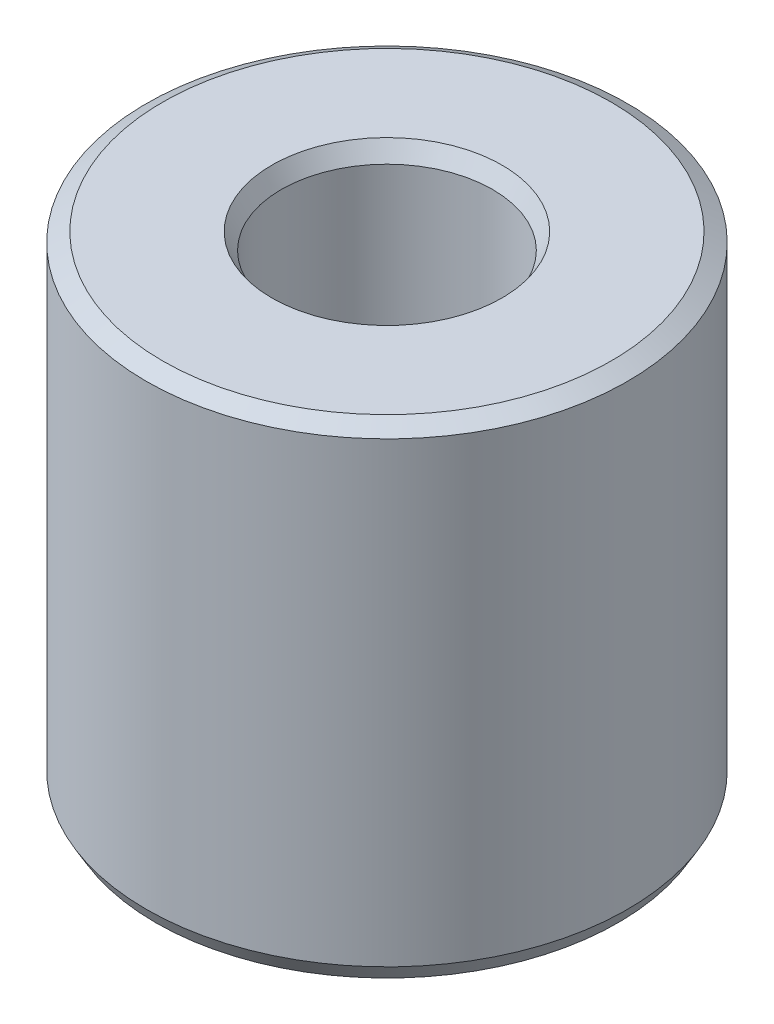
ISO-10303-21;
HEADER;
FILE_DESCRIPTION(('STEP AP214'),'2;1');
FILE_NAME('part.step','',(''),(''),'','','');
FILE_SCHEMA(('AUTOMOTIVE_DESIGN { 1 0 10303 214 1 1 1 1 }'));
ENDSEC;
DATA;
#1=APPLICATION_CONTEXT('core data for automotive mechanical design processes');
#2=APPLICATION_PROTOCOL_DEFINITION('international standard','automotive_design',2000,#1);
#3=PRODUCT_CONTEXT('',#1,'mechanical');
#4=PRODUCT('Part','Part','',(#3));
#5=PRODUCT_RELATED_PRODUCT_CATEGORY('part','',(#4));
#6=PRODUCT_DEFINITION_FORMATION('','',#4);
#7=PRODUCT_DEFINITION_CONTEXT('part definition',#1,'design');
#8=PRODUCT_DEFINITION('design','',#6,#7);
#9=PRODUCT_DEFINITION_SHAPE('','',#8);
#10=(LENGTH_UNIT() NAMED_UNIT(*) SI_UNIT(.MILLI.,.METRE.));
#11=(NAMED_UNIT(*) PLANE_ANGLE_UNIT() SI_UNIT($,.RADIAN.));
#12=(NAMED_UNIT(*) SI_UNIT($,.STERADIAN.) SOLID_ANGLE_UNIT());
#13=UNCERTAINTY_MEASURE_WITH_UNIT(LENGTH_MEASURE(1.E-05),#10,'distance_accuracy_value','');
#14=(GEOMETRIC_REPRESENTATION_CONTEXT(3) GLOBAL_UNCERTAINTY_ASSIGNED_CONTEXT((#13)) GLOBAL_UNIT_ASSIGNED_CONTEXT((#10,
#11,#12)) REPRESENTATION_CONTEXT('',''));
#15=CARTESIAN_POINT('',(0.,0.,0.));
#16=DIRECTION('',(0.,0.,1.));
#17=DIRECTION('',(1.,0.,0.));
#18=AXIS2_PLACEMENT_3D('',#15,#16,#17);
#19=CARTESIAN_POINT('',(0.,15.0570823456874,0.));
#20=DIRECTION('',(0.,-1.,0.));
#21=DIRECTION('',(0.,0.,-1.));
#22=AXIS2_PLACEMENT_3D('',#19,#20,#21);
#23=CYLINDRICAL_SURFACE('',#22,7.5);
#24=CARTESIAN_POINT('',(0.,0.51015463195985,0.));
#25=DIRECTION('',(0.,1.,0.));
#26=DIRECTION('',(0.,0.,1.));
#27=AXIS2_PLACEMENT_3D('',#24,#25,#26);
#28=CIRCLE('',#27,7.5);
#29=CARTESIAN_POINT('',(0.,0.51015463195985,7.5));
#30=VERTEX_POINT('',#29);
#31=EDGE_CURVE('E10',#30,#30,#28,.T.);
#32=ORIENTED_EDGE('',*,*,#31,.T.);
#33=EDGE_LOOP('',(#32));
#34=FACE_BOUND('',#33,.T.);
#35=CARTESIAN_POINT('',(0.,14.7625444315971,0.));
#36=DIRECTION('',(0.,1.,0.));
#37=DIRECTION('',(0.,0.,1.));
#38=AXIS2_PLACEMENT_3D('',#35,#36,#37);
#39=CIRCLE('',#38,7.5);
#40=CARTESIAN_POINT('',(0.,14.7625444315971,7.5));
#41=VERTEX_POINT('',#40);
#42=EDGE_CURVE('E50',#41,#41,#39,.F.);
#43=ORIENTED_EDGE('',*,*,#42,.T.);
#44=EDGE_LOOP('',(#43));
#45=FACE_BOUND('',#44,.T.);
#46=ADVANCED_FACE('F39',(#34,#45),#23,.T.);
#47=CARTESIAN_POINT('',(0.,15.0570823456874,0.));
#48=DIRECTION('',(0.,1.,0.));
#49=DIRECTION('',(0.,0.,1.));
#50=AXIS2_PLACEMENT_3D('',#47,#48,#49);
#51=PLANE('',#50);
#52=CARTESIAN_POINT('',(0.,15.0570823456874,0.));
#53=DIRECTION('',(0.,1.,0.));
#54=DIRECTION('',(0.,0.,1.));
#55=AXIS2_PLACEMENT_3D('',#52,#53,#54);
#56=CIRCLE('',#55,3.58817259000457);
#57=CARTESIAN_POINT('',(0.,15.0570823456874,3.58817259000457));
#58=VERTEX_POINT('',#57);
#59=EDGE_CURVE('E58',#58,#58,#56,.F.);
#60=ORIENTED_EDGE('',*,*,#59,.T.);
#61=EDGE_LOOP('',(#60));
#62=FACE_BOUND('',#61,.T.);
#63=CARTESIAN_POINT('',(0.,15.0570823456874,0.));
#64=DIRECTION('',(0.,1.,0.));
#65=DIRECTION('',(0.,0.,1.));
#66=AXIS2_PLACEMENT_3D('',#63,#64,#65);
#67=CIRCLE('',#66,6.98984536804015);
#68=CARTESIAN_POINT('',(0.,15.0570823456874,6.98984536804015));
#69=VERTEX_POINT('',#68);
#70=EDGE_CURVE('E61',#69,#69,#67,.T.);
#71=ORIENTED_EDGE('',*,*,#70,.T.);
#72=EDGE_LOOP('',(#71));
#73=FACE_BOUND('',#72,.T.);
#74=ADVANCED_FACE('F88',(#62,#73),#51,.T.);
#75=CARTESIAN_POINT('',(0.,0.,0.));
#76=DIRECTION('',(0.,1.,0.));
#77=DIRECTION('',(0.,0.,1.));
#78=AXIS2_PLACEMENT_3D('',#75,#76,#77);
#79=PLANE('',#78);
#80=CARTESIAN_POINT('',(0.,0.,0.));
#81=DIRECTION('',(0.,1.,0.));
#82=DIRECTION('',(0.,0.,1.));
#83=AXIS2_PLACEMENT_3D('',#80,#81,#82);
#84=CIRCLE('',#83,3.80378930787406);
#85=CARTESIAN_POINT('',(0.,0.,3.80378930787406));
#86=VERTEX_POINT('',#85);
#87=EDGE_CURVE('E51',#86,#86,#84,.T.);
#88=ORIENTED_EDGE('',*,*,#87,.T.);
#89=EDGE_LOOP('',(#88));
#90=FACE_BOUND('',#89,.T.);
#91=CARTESIAN_POINT('',(0.,0.,0.));
#92=DIRECTION('',(0.,1.,0.));
#93=DIRECTION('',(0.,0.,1.));
#94=AXIS2_PLACEMENT_3D('',#91,#92,#93);
#95=CIRCLE('',#94,7.20546208590964);
#96=CARTESIAN_POINT('',(0.,0.,7.20546208590964));
#97=VERTEX_POINT('',#96);
#98=EDGE_CURVE('E54',#97,#97,#95,.F.);
#99=ORIENTED_EDGE('',*,*,#98,.T.);
#100=EDGE_LOOP('',(#99));
#101=FACE_BOUND('',#100,.T.);
#102=ADVANCED_FACE('F83',(#90,#101),#79,.F.);
#103=CARTESIAN_POINT('',(0.,15.0570823456874,0.));
#104=DIRECTION('',(0.,-1.,0.));
#105=DIRECTION('',(0.,0.,-1.));
#106=AXIS2_PLACEMENT_3D('',#103,#104,#105);
#107=CYLINDRICAL_SURFACE('',#106,3.29363467591421);
#108=CARTESIAN_POINT('',(0.,14.5469277137276,0.));
#109=DIRECTION('',(0.,1.,0.));
#110=DIRECTION('',(0.,0.,1.));
#111=AXIS2_PLACEMENT_3D('',#108,#109,#110);
#112=CIRCLE('',#111,3.29363467591421);
#113=CARTESIAN_POINT('',(0.,14.5469277137276,3.29363467591421));
#114=VERTEX_POINT('',#113);
#115=EDGE_CURVE('E67',#114,#114,#112,.T.);
#116=ORIENTED_EDGE('',*,*,#115,.T.);
#117=EDGE_LOOP('',(#116));
#118=FACE_BOUND('',#117,.T.);
#119=CARTESIAN_POINT('',(0.,0.294537914090356,0.));
#120=DIRECTION('',(0.,1.,0.));
#121=DIRECTION('',(0.,0.,1.));
#122=AXIS2_PLACEMENT_3D('',#119,#120,#121);
#123=CIRCLE('',#122,3.29363467591421);
#124=CARTESIAN_POINT('',(0.,0.294537914090356,3.29363467591421));
#125=VERTEX_POINT('',#124);
#126=EDGE_CURVE('E69',#125,#125,#123,.F.);
#127=ORIENTED_EDGE('',*,*,#126,.T.);
#128=EDGE_LOOP('',(#127));
#129=FACE_BOUND('',#128,.T.);
#130=ADVANCED_FACE('F71',(#118,#129),#107,.F.);
#131=CARTESIAN_POINT('',(0.,14.5469277137276,0.));
#132=DIRECTION('',(0.,1.,0.));
#133=DIRECTION('',(0.,0.,1.));
#134=AXIS2_PLACEMENT_3D('',#131,#132,#133);
#135=CONICAL_SURFACE('',#134,3.29363467591421,0.523598775598304);
#136=ORIENTED_EDGE('',*,*,#59,.F.);
#137=EDGE_LOOP('',(#136));
#138=FACE_BOUND('',#137,.T.);
#139=ORIENTED_EDGE('',*,*,#115,.F.);
#140=EDGE_LOOP('',(#139));
#141=FACE_BOUND('',#140,.T.);
#142=ADVANCED_FACE('F77',(#138,#141),#135,.F.);
#143=CARTESIAN_POINT('',(0.,0.,0.));
#144=DIRECTION('',(0.,-1.,0.));
#145=DIRECTION('',(0.,0.,-1.));
#146=AXIS2_PLACEMENT_3D('',#143,#144,#145);
#147=CONICAL_SURFACE('',#146,3.80378930787406,1.0471975511966);
#148=ORIENTED_EDGE('',*,*,#126,.F.);
#149=EDGE_LOOP('',(#148));
#150=FACE_BOUND('',#149,.T.);
#151=ORIENTED_EDGE('',*,*,#87,.F.);
#152=EDGE_LOOP('',(#151));
#153=FACE_BOUND('',#152,.T.);
#154=ADVANCED_FACE('F73',(#150,#153),#147,.F.);
#155=CARTESIAN_POINT('',(0.,0.51015463195985,0.));
#156=DIRECTION('',(0.,1.,0.));
#157=DIRECTION('',(0.,0.,1.));
#158=AXIS2_PLACEMENT_3D('',#155,#156,#157);
#159=CONICAL_SURFACE('',#158,7.5,0.523598775598302);
#160=ORIENTED_EDGE('',*,*,#98,.F.);
#161=EDGE_LOOP('',(#160));
#162=FACE_BOUND('',#161,.T.);
#163=ORIENTED_EDGE('',*,*,#31,.F.);
#164=EDGE_LOOP('',(#163));
#165=FACE_BOUND('',#164,.T.);
#166=ADVANCED_FACE('F76',(#162,#165),#159,.T.);
#167=CARTESIAN_POINT('',(0.,15.0570823456874,0.));
#168=DIRECTION('',(0.,-1.,0.));
#169=DIRECTION('',(0.,0.,-1.));
#170=AXIS2_PLACEMENT_3D('',#167,#168,#169);
#171=CONICAL_SURFACE('',#170,6.98984536804015,1.0471975511966);
#172=ORIENTED_EDGE('',*,*,#42,.F.);
#173=EDGE_LOOP('',(#172));
#174=FACE_BOUND('',#173,.T.);
#175=ORIENTED_EDGE('',*,*,#70,.F.);
#176=EDGE_LOOP('',(#175));
#177=FACE_BOUND('',#176,.T.);
#178=ADVANCED_FACE('F45',(#174,#177),#171,.T.);
#179=CLOSED_SHELL('',(#46,#74,#102,#130,#142,#154,#166,#178));
#180=MANIFOLD_SOLID_BREP('B2',#179);
#181=ADVANCED_BREP_SHAPE_REPRESENTATION('',(#18,#180),#14);
#182=SHAPE_DEFINITION_REPRESENTATION(#9,#181);
ENDSEC;
END-ISO-10303-21;
